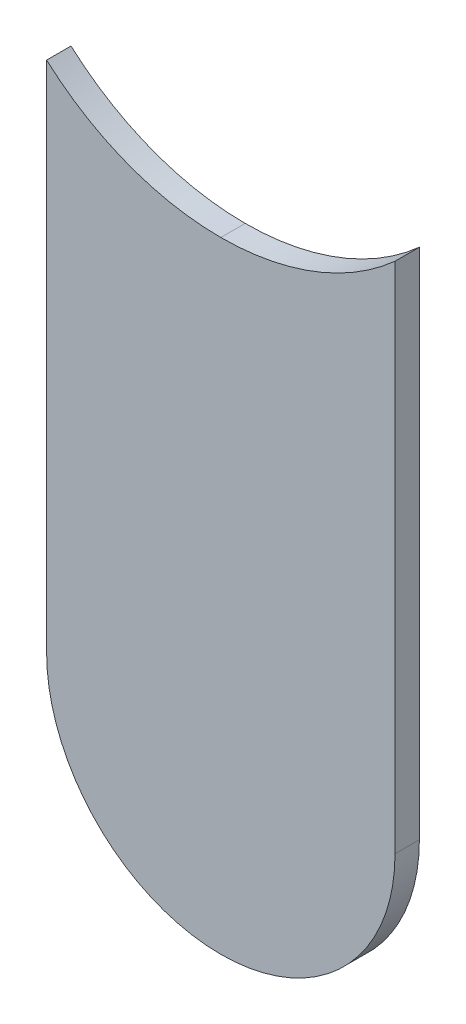
ISO-10303-21;
HEADER;
FILE_DESCRIPTION(('STEP AP214'),'2;1');
FILE_NAME('part.step','',(''),(''),'','','');
FILE_SCHEMA(('AUTOMOTIVE_DESIGN { 1 0 10303 214 1 1 1 1 }'));
ENDSEC;
DATA;
#1=APPLICATION_CONTEXT('core data for automotive mechanical design processes');
#2=APPLICATION_PROTOCOL_DEFINITION('international standard','automotive_design',2000,#1);
#3=PRODUCT_CONTEXT('',#1,'mechanical');
#4=PRODUCT('Part','Part','',(#3));
#5=PRODUCT_RELATED_PRODUCT_CATEGORY('part','',(#4));
#6=PRODUCT_DEFINITION_FORMATION('','',#4);
#7=PRODUCT_DEFINITION_CONTEXT('part definition',#1,'design');
#8=PRODUCT_DEFINITION('design','',#6,#7);
#9=PRODUCT_DEFINITION_SHAPE('','',#8);
#10=(LENGTH_UNIT() NAMED_UNIT(*) SI_UNIT(.MILLI.,.METRE.));
#11=(NAMED_UNIT(*) PLANE_ANGLE_UNIT() SI_UNIT($,.RADIAN.));
#12=(NAMED_UNIT(*) SI_UNIT($,.STERADIAN.) SOLID_ANGLE_UNIT());
#13=UNCERTAINTY_MEASURE_WITH_UNIT(LENGTH_MEASURE(1.E-05),#10,'distance_accuracy_value','');
#14=(GEOMETRIC_REPRESENTATION_CONTEXT(3) GLOBAL_UNCERTAINTY_ASSIGNED_CONTEXT((#13)) GLOBAL_UNIT_ASSIGNED_CONTEXT((#10,
#11,#12)) REPRESENTATION_CONTEXT('',''));
#15=CARTESIAN_POINT('',(0.,0.,0.));
#16=DIRECTION('',(0.,0.,1.));
#17=DIRECTION('',(1.,0.,0.));
#18=AXIS2_PLACEMENT_3D('',#15,#16,#17);
#19=CARTESIAN_POINT('',(137.16,-103.632,-0.045));
#20=DIRECTION('',(0.,0.,-1.));
#21=DIRECTION('',(0.,-1.,0.));
#22=AXIS2_PLACEMENT_3D('',#19,#20,#21);
#23=CYLINDRICAL_SURFACE('',#22,0.375);
#24=DIRECTION('',(0.,0.,1.));
#25=VECTOR('',#24,1.);
#26=CARTESIAN_POINT('',(137.16,-104.007,-0.045));
#27=LINE('',#26,#25);
#28=CARTESIAN_POINT('',(137.16,-104.007,-0.035));
#29=VERTEX_POINT('',#28);
#30=CARTESIAN_POINT('',(137.16,-104.007,0.));
#31=VERTEX_POINT('',#30);
#32=EDGE_CURVE('E86',#29,#31,#27,.T.);
#33=ORIENTED_EDGE('',*,*,#32,.F.);
#34=CARTESIAN_POINT('',(137.16,-103.632,-0.035));
#35=DIRECTION('',(0.,0.,-1.));
#36=DIRECTION('',(0.,-1.,0.));
#37=AXIS2_PLACEMENT_3D('',#34,#35,#36);
#38=CIRCLE('',#37,0.375);
#39=CARTESIAN_POINT('',(136.91,-103.9115084972,-0.035));
#40=VERTEX_POINT('',#39);
#41=EDGE_CURVE('E124',#29,#40,#38,.T.);
#42=ORIENTED_EDGE('',*,*,#41,.T.);
#43=DIRECTION('',(0.,0.,-1.));
#44=VECTOR('',#43,1.);
#45=CARTESIAN_POINT('',(136.91,-103.9115084971,-0.045));
#46=LINE('',#45,#44);
#47=CARTESIAN_POINT('',(136.91,-103.9115084972,0.));
#48=VERTEX_POINT('',#47);
#49=EDGE_CURVE('E11',#48,#40,#46,.T.);
#50=ORIENTED_EDGE('',*,*,#49,.F.);
#51=CARTESIAN_POINT('',(137.16,-103.632,0.));
#52=DIRECTION('',(0.,0.,-1.));
#53=DIRECTION('',(0.,-1.,0.));
#54=AXIS2_PLACEMENT_3D('',#51,#52,#53);
#55=CIRCLE('',#54,0.375);
#56=EDGE_CURVE('E132',#31,#48,#55,.T.);
#57=ORIENTED_EDGE('',*,*,#56,.F.);
#58=EDGE_LOOP('',(#33,#42,#50,#57));
#59=FACE_BOUND('',#58,.T.);
#60=ADVANCED_FACE('F17',(#59),#23,.F.);
#61=CARTESIAN_POINT('',(136.91,-103.632,-0.035));
#62=DIRECTION('',(1.,0.,0.));
#63=DIRECTION('',(0.,1.,0.));
#64=AXIS2_PLACEMENT_3D('',#61,#62,#63);
#65=PLANE('',#64);
#66=DIRECTION('',(0.,0.,1.));
#67=VECTOR('',#66,1.);
#68=CARTESIAN_POINT('',(136.91,-104.648,-0.035));
#69=LINE('',#68,#67);
#70=CARTESIAN_POINT('',(136.91,-104.648,-0.035));
#71=VERTEX_POINT('',#70);
#72=CARTESIAN_POINT('',(136.91,-104.648,0.));
#73=VERTEX_POINT('',#72);
#74=EDGE_CURVE('E26',#71,#73,#69,.T.);
#75=ORIENTED_EDGE('',*,*,#74,.T.);
#76=DIRECTION('',(0.,-1.,0.));
#77=VECTOR('',#76,1.);
#78=CARTESIAN_POINT('',(136.91,-103.632,0.));
#79=LINE('',#78,#77);
#80=EDGE_CURVE('E20',#48,#73,#79,.T.);
#81=ORIENTED_EDGE('',*,*,#80,.F.);
#82=ORIENTED_EDGE('',*,*,#49,.T.);
#83=DIRECTION('',(0.,-1.,0.));
#84=VECTOR('',#83,1.);
#85=CARTESIAN_POINT('',(136.91,-103.632,-0.035));
#86=LINE('',#85,#84);
#87=EDGE_CURVE('E119',#40,#71,#86,.T.);
#88=ORIENTED_EDGE('',*,*,#87,.T.);
#89=EDGE_LOOP('',(#75,#81,#82,#88));
#90=FACE_BOUND('',#89,.T.);
#91=ADVANCED_FACE('F148',(#90),#65,.F.);
#92=CARTESIAN_POINT('',(137.16,-104.648,-0.035));
#93=DIRECTION('',(0.,0.,-1.));
#94=DIRECTION('',(-1.,0.,0.));
#95=AXIS2_PLACEMENT_3D('',#92,#93,#94);
#96=CYLINDRICAL_SURFACE('',#95,0.25);
#97=CARTESIAN_POINT('',(137.16,-104.648,-0.035));
#98=DIRECTION('',(0.,0.,1.));
#99=DIRECTION('',(-1.,0.,0.));
#100=AXIS2_PLACEMENT_3D('',#97,#98,#99);
#101=CIRCLE('',#100,0.25);
#102=CARTESIAN_POINT('',(137.41,-104.648,-0.035));
#103=VERTEX_POINT('',#102);
#104=EDGE_CURVE('E113',#71,#103,#101,.T.);
#105=ORIENTED_EDGE('',*,*,#104,.T.);
#106=DIRECTION('',(0.,0.,1.));
#107=VECTOR('',#106,1.);
#108=CARTESIAN_POINT('',(137.41,-104.648,-0.035));
#109=LINE('',#108,#107);
#110=CARTESIAN_POINT('',(137.41,-104.648,0.));
#111=VERTEX_POINT('',#110);
#112=EDGE_CURVE('E100',#103,#111,#109,.T.);
#113=ORIENTED_EDGE('',*,*,#112,.T.);
#114=CARTESIAN_POINT('',(137.16,-104.648,0.));
#115=DIRECTION('',(0.,0.,1.));
#116=DIRECTION('',(-1.,0.,0.));
#117=AXIS2_PLACEMENT_3D('',#114,#115,#116);
#118=CIRCLE('',#117,0.25);
#119=EDGE_CURVE('E90',#73,#111,#118,.T.);
#120=ORIENTED_EDGE('',*,*,#119,.F.);
#121=ORIENTED_EDGE('',*,*,#74,.F.);
#122=EDGE_LOOP('',(#105,#113,#120,#121));
#123=FACE_BOUND('',#122,.T.);
#124=ADVANCED_FACE('F140',(#123),#96,.T.);
#125=CARTESIAN_POINT('',(137.41,-104.648,0.));
#126=DIRECTION('',(0.,0.,1.));
#127=DIRECTION('',(1.,0.,0.));
#128=AXIS2_PLACEMENT_3D('',#125,#126,#127);
#129=PLANE('',#128);
#130=ORIENTED_EDGE('',*,*,#119,.T.);
#131=DIRECTION('',(0.,1.,0.));
#132=VECTOR('',#131,1.);
#133=CARTESIAN_POINT('',(137.41,-104.648,0.));
#134=LINE('',#133,#132);
#135=CARTESIAN_POINT('',(137.41,-103.9115084971,0.));
#136=VERTEX_POINT('',#135);
#137=EDGE_CURVE('E93',#111,#136,#134,.T.);
#138=ORIENTED_EDGE('',*,*,#137,.T.);
#139=CARTESIAN_POINT('',(137.16,-103.632,0.));
#140=DIRECTION('',(0.,0.,-1.));
#141=DIRECTION('',(0.,-1.,0.));
#142=AXIS2_PLACEMENT_3D('',#139,#140,#141);
#143=CIRCLE('',#142,0.375);
#144=EDGE_CURVE('E80',#136,#31,#143,.T.);
#145=ORIENTED_EDGE('',*,*,#144,.T.);
#146=ORIENTED_EDGE('',*,*,#56,.T.);
#147=ORIENTED_EDGE('',*,*,#80,.T.);
#148=EDGE_LOOP('',(#130,#138,#145,#146,#147));
#149=FACE_BOUND('',#148,.T.);
#150=ADVANCED_FACE('F94',(#149),#129,.T.);
#151=CARTESIAN_POINT('',(137.16,-103.632,-0.045));
#152=DIRECTION('',(0.,0.,-1.));
#153=DIRECTION('',(0.,-1.,0.));
#154=AXIS2_PLACEMENT_3D('',#151,#152,#153);
#155=CYLINDRICAL_SURFACE('',#154,0.375);
#156=CARTESIAN_POINT('',(137.16,-103.632,-0.035));
#157=DIRECTION('',(0.,0.,-1.));
#158=DIRECTION('',(0.,-1.,0.));
#159=AXIS2_PLACEMENT_3D('',#156,#157,#158);
#160=CIRCLE('',#159,0.375);
#161=CARTESIAN_POINT('',(137.41,-103.9115084971,-0.035));
#162=VERTEX_POINT('',#161);
#163=EDGE_CURVE('E121',#162,#29,#160,.T.);
#164=ORIENTED_EDGE('',*,*,#163,.T.);
#165=ORIENTED_EDGE('',*,*,#32,.T.);
#166=ORIENTED_EDGE('',*,*,#144,.F.);
#167=DIRECTION('',(0.,0.,-1.));
#168=VECTOR('',#167,1.);
#169=CARTESIAN_POINT('',(137.41,-103.9115084971,-0.045));
#170=LINE('',#169,#168);
#171=EDGE_CURVE('E85',#136,#162,#170,.T.);
#172=ORIENTED_EDGE('',*,*,#171,.T.);
#173=EDGE_LOOP('',(#164,#165,#166,#172));
#174=FACE_BOUND('',#173,.T.);
#175=ADVANCED_FACE('F83',(#174),#155,.F.);
#176=CARTESIAN_POINT('',(137.41,-104.648,-0.035));
#177=DIRECTION('',(0.,0.,1.));
#178=DIRECTION('',(1.,0.,0.));
#179=AXIS2_PLACEMENT_3D('',#176,#177,#178);
#180=PLANE('',#179);
#181=ORIENTED_EDGE('',*,*,#87,.F.);
#182=ORIENTED_EDGE('',*,*,#41,.F.);
#183=ORIENTED_EDGE('',*,*,#163,.F.);
#184=DIRECTION('',(0.,1.,0.));
#185=VECTOR('',#184,1.);
#186=CARTESIAN_POINT('',(137.41,-104.648,-0.035));
#187=LINE('',#186,#185);
#188=EDGE_CURVE('E105',#103,#162,#187,.T.);
#189=ORIENTED_EDGE('',*,*,#188,.F.);
#190=ORIENTED_EDGE('',*,*,#104,.F.);
#191=EDGE_LOOP('',(#181,#182,#183,#189,#190));
#192=FACE_BOUND('',#191,.T.);
#193=ADVANCED_FACE('F145',(#192),#180,.F.);
#194=CARTESIAN_POINT('',(137.41,-104.648,-0.035));
#195=DIRECTION('',(-1.,0.,0.));
#196=DIRECTION('',(0.,0.,1.));
#197=AXIS2_PLACEMENT_3D('',#194,#195,#196);
#198=PLANE('',#197);
#199=ORIENTED_EDGE('',*,*,#171,.F.);
#200=ORIENTED_EDGE('',*,*,#137,.F.);
#201=ORIENTED_EDGE('',*,*,#112,.F.);
#202=ORIENTED_EDGE('',*,*,#188,.T.);
#203=EDGE_LOOP('',(#199,#200,#201,#202));
#204=FACE_BOUND('',#203,.T.);
#205=ADVANCED_FACE('F103',(#204),#198,.F.);
#206=CLOSED_SHELL('',(#60,#91,#124,#150,#175,#193,#205));
#207=MANIFOLD_SOLID_BREP('B1',#206);
#208=ADVANCED_BREP_SHAPE_REPRESENTATION('',(#18,#207),#14);
#209=SHAPE_DEFINITION_REPRESENTATION(#9,#208);
ENDSEC;
END-ISO-10303-21;
